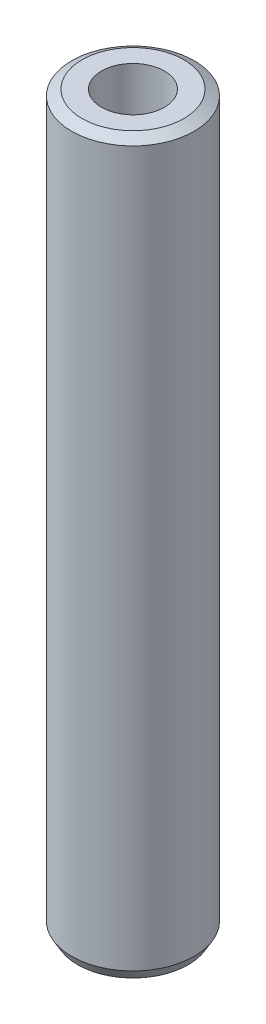
ISO-10303-21;
HEADER;
FILE_DESCRIPTION(('STEP AP214'),'2;1');
FILE_NAME('part.step','',(''),(''),'','','');
FILE_SCHEMA(('AUTOMOTIVE_DESIGN { 1 0 10303 214 1 1 1 1 }'));
ENDSEC;
DATA;
#1=APPLICATION_CONTEXT('core data for automotive mechanical design processes');
#2=APPLICATION_PROTOCOL_DEFINITION('international standard','automotive_design',2000,#1);
#3=PRODUCT_CONTEXT('',#1,'mechanical');
#4=PRODUCT('Part','Part','',(#3));
#5=PRODUCT_RELATED_PRODUCT_CATEGORY('part','',(#4));
#6=PRODUCT_DEFINITION_FORMATION('','',#4);
#7=PRODUCT_DEFINITION_CONTEXT('part definition',#1,'design');
#8=PRODUCT_DEFINITION('design','',#6,#7);
#9=PRODUCT_DEFINITION_SHAPE('','',#8);
#10=(LENGTH_UNIT() NAMED_UNIT(*) SI_UNIT(.MILLI.,.METRE.));
#11=(NAMED_UNIT(*) PLANE_ANGLE_UNIT() SI_UNIT($,.RADIAN.));
#12=(NAMED_UNIT(*) SI_UNIT($,.STERADIAN.) SOLID_ANGLE_UNIT());
#13=UNCERTAINTY_MEASURE_WITH_UNIT(LENGTH_MEASURE(1.E-05),#10,'distance_accuracy_value','');
#14=(GEOMETRIC_REPRESENTATION_CONTEXT(3) GLOBAL_UNCERTAINTY_ASSIGNED_CONTEXT((#13)) GLOBAL_UNIT_ASSIGNED_CONTEXT((#10,
#11,#12)) REPRESENTATION_CONTEXT('',''));
#15=CARTESIAN_POINT('',(0.,0.,0.));
#16=DIRECTION('',(0.,0.,1.));
#17=DIRECTION('',(1.,0.,0.));
#18=AXIS2_PLACEMENT_3D('',#15,#16,#17);
#19=CARTESIAN_POINT('',(0.,149.163204077294,0.));
#20=DIRECTION('',(0.,-1.,0.));
#21=DIRECTION('',(0.,0.,-1.));
#22=AXIS2_PLACEMENT_3D('',#19,#20,#21);
#23=CYLINDRICAL_SURFACE('',#22,12.5);
#24=CARTESIAN_POINT('',(0.,147.95170279504,0.));
#25=DIRECTION('',(0.,1.,0.));
#26=DIRECTION('',(0.,0.,1.));
#27=AXIS2_PLACEMENT_3D('',#24,#25,#26);
#28=CIRCLE('',#27,12.5);
#29=CARTESIAN_POINT('',(0.,147.95170279504,12.5));
#30=VERTEX_POINT('',#29);
#31=EDGE_CURVE('E50',#30,#30,#28,.F.);
#32=ORIENTED_EDGE('',*,*,#31,.T.);
#33=EDGE_LOOP('',(#32));
#34=FACE_BOUND('',#33,.T.);
#35=CARTESIAN_POINT('',(0.,2.09838177429911,0.));
#36=DIRECTION('',(0.,1.,0.));
#37=DIRECTION('',(0.,0.,1.));
#38=AXIS2_PLACEMENT_3D('',#35,#36,#37);
#39=CIRCLE('',#38,12.5);
#40=CARTESIAN_POINT('',(0.,2.09838177429911,12.5));
#41=VERTEX_POINT('',#40);
#42=EDGE_CURVE('E51',#41,#41,#39,.T.);
#43=ORIENTED_EDGE('',*,*,#42,.T.);
#44=EDGE_LOOP('',(#43));
#45=FACE_BOUND('',#44,.T.);
#46=ADVANCED_FACE('F39',(#34,#45),#23,.T.);
#47=CARTESIAN_POINT('',(0.,149.163204077294,0.));
#48=DIRECTION('',(0.,1.,0.));
#49=DIRECTION('',(0.,0.,1.));
#50=AXIS2_PLACEMENT_3D('',#47,#48,#49);
#51=PLANE('',#50);
#52=CARTESIAN_POINT('',(0.,149.163204077294,0.));
#53=DIRECTION('',(0.,1.,0.));
#54=DIRECTION('',(0.,0.,1.));
#55=AXIS2_PLACEMENT_3D('',#52,#53,#54);
#56=CIRCLE('',#55,10.4016182257009);
#57=CARTESIAN_POINT('',(0.,149.163204077294,10.4016182257009));
#58=VERTEX_POINT('',#57);
#59=EDGE_CURVE('E54',#58,#58,#56,.T.);
#60=ORIENTED_EDGE('',*,*,#59,.T.);
#61=EDGE_LOOP('',(#60));
#62=FACE_BOUND('',#61,.T.);
#63=CARTESIAN_POINT('',(0.,149.163204077294,0.));
#64=DIRECTION('',(0.,1.,0.));
#65=DIRECTION('',(0.,0.,1.));
#66=AXIS2_PLACEMENT_3D('',#63,#64,#65);
#67=CIRCLE('',#66,6.42428376195019);
#68=CARTESIAN_POINT('',(0.,149.163204077294,6.42428376195019));
#69=VERTEX_POINT('',#68);
#70=EDGE_CURVE('E58',#69,#69,#67,.T.);
#71=ORIENTED_EDGE('',*,*,#70,.F.);
#72=EDGE_LOOP('',(#71));
#73=FACE_BOUND('',#72,.T.);
#74=ADVANCED_FACE('F69',(#62,#73),#51,.T.);
#75=CARTESIAN_POINT('',(0.,0.,0.));
#76=DIRECTION('',(0.,1.,0.));
#77=DIRECTION('',(0.,0.,1.));
#78=AXIS2_PLACEMENT_3D('',#75,#76,#77);
#79=PLANE('',#78);
#80=CARTESIAN_POINT('',(0.,0.,0.));
#81=DIRECTION('',(0.,1.,0.));
#82=DIRECTION('',(0.,0.,1.));
#83=AXIS2_PLACEMENT_3D('',#80,#81,#82);
#84=CIRCLE('',#83,11.2884987177458);
#85=CARTESIAN_POINT('',(0.,0.,11.2884987177458));
#86=VERTEX_POINT('',#85);
#87=EDGE_CURVE('E10',#86,#86,#84,.F.);
#88=ORIENTED_EDGE('',*,*,#87,.T.);
#89=EDGE_LOOP('',(#88));
#90=FACE_BOUND('',#89,.T.);
#91=CARTESIAN_POINT('',(0.,0.,0.));
#92=DIRECTION('',(0.,1.,0.));
#93=DIRECTION('',(0.,0.,1.));
#94=AXIS2_PLACEMENT_3D('',#91,#92,#93);
#95=CIRCLE('',#94,6.42428376195019);
#96=CARTESIAN_POINT('',(0.,0.,6.42428376195019));
#97=VERTEX_POINT('',#96);
#98=EDGE_CURVE('E63',#97,#97,#95,.T.);
#99=ORIENTED_EDGE('',*,*,#98,.T.);
#100=EDGE_LOOP('',(#99));
#101=FACE_BOUND('',#100,.T.);
#102=ADVANCED_FACE('F75',(#90,#101),#79,.F.);
#103=CARTESIAN_POINT('',(0.,149.163204077294,0.));
#104=DIRECTION('',(0.,-1.,0.));
#105=DIRECTION('',(0.,0.,-1.));
#106=AXIS2_PLACEMENT_3D('',#103,#104,#105);
#107=CYLINDRICAL_SURFACE('',#106,6.42428376195019);
#108=ORIENTED_EDGE('',*,*,#70,.T.);
#109=EDGE_LOOP('',(#108));
#110=FACE_BOUND('',#109,.T.);
#111=ORIENTED_EDGE('',*,*,#98,.F.);
#112=EDGE_LOOP('',(#111));
#113=FACE_BOUND('',#112,.T.);
#114=ADVANCED_FACE('F70',(#110,#113),#107,.F.);
#115=CARTESIAN_POINT('',(0.,149.163204077294,0.));
#116=DIRECTION('',(0.,-1.,0.));
#117=DIRECTION('',(0.,0.,-1.));
#118=AXIS2_PLACEMENT_3D('',#115,#116,#117);
#119=CONICAL_SURFACE('',#118,10.4016182257009,1.0471975511966);
#120=ORIENTED_EDGE('',*,*,#31,.F.);
#121=EDGE_LOOP('',(#120));
#122=FACE_BOUND('',#121,.T.);
#123=ORIENTED_EDGE('',*,*,#59,.F.);
#124=EDGE_LOOP('',(#123));
#125=FACE_BOUND('',#124,.T.);
#126=ADVANCED_FACE('F81',(#122,#125),#119,.T.);
#127=CARTESIAN_POINT('',(0.,2.09838177429911,0.));
#128=DIRECTION('',(0.,1.,0.));
#129=DIRECTION('',(0.,0.,1.));
#130=AXIS2_PLACEMENT_3D('',#127,#128,#129);
#131=CONICAL_SURFACE('',#130,12.5,0.523598775598306);
#132=CARTESIAN_POINT('',(0.,0.,11.2884987177458));
#133=CARTESIAN_POINT('',(0.,0.0218581434822816,11.3011185227693));
#134=CARTESIAN_POINT('',(0.,0.043716286964564,11.3137383277928));
#135=CARTESIAN_POINT('',(0.,0.087432573929129,11.3389779378397));
#136=CARTESIAN_POINT('',(0.,0.109290717411412,11.3515977428632));
#137=CARTESIAN_POINT('',(0.,0.153007004375976,11.3768373529102));
#138=CARTESIAN_POINT('',(0.,0.174865147858258,11.3894571579336));
#139=CARTESIAN_POINT('',(0.,0.218581434822823,11.4146967679806));
#140=CARTESIAN_POINT('',(0.,0.240439578305105,11.4273165730041));
#141=CARTESIAN_POINT('',(0.,0.28415586526967,11.452556183051));
#142=CARTESIAN_POINT('',(0.,0.306014008751953,11.4651759880745));
#143=CARTESIAN_POINT('',(0.,0.349730295716517,11.4904155981215));
#144=CARTESIAN_POINT('',(0.,0.3715884391988,11.503035403145));
#145=CARTESIAN_POINT('',(0.,0.415304726163365,11.5282750131919));
#146=CARTESIAN_POINT('',(0.,0.437162869645647,11.5408948182154));
#147=CARTESIAN_POINT('',(0.,0.480879156610212,11.5661344282624));
#148=CARTESIAN_POINT('',(0.,0.502737300092494,11.5787542332859));
#149=CARTESIAN_POINT('',(0.,0.546453587057059,11.6039938433328));
#150=CARTESIAN_POINT('',(0.,0.568311730539341,11.6166136483563));
#151=CARTESIAN_POINT('',(0.,0.612028017503906,11.6418532584033));
#152=CARTESIAN_POINT('',(0.,0.633886160986188,11.6544730634267));
#153=CARTESIAN_POINT('',(0.,0.677602447950753,11.6797126734737));
#154=CARTESIAN_POINT('',(0.,0.699460591433036,11.6923324784972));
#155=CARTESIAN_POINT('',(0.,0.7431768783976,11.7175720885442));
#156=CARTESIAN_POINT('',(0.,0.765035021879882,11.7301918935676));
#157=CARTESIAN_POINT('',(0.,0.808751308844447,11.7554315036146));
#158=CARTESIAN_POINT('',(0.,0.83060945232673,11.7680513086381));
#159=CARTESIAN_POINT('',(0.,0.874325739291295,11.793290918685));
#160=CARTESIAN_POINT('',(0.,0.896183882773577,11.8059107237085));
#161=CARTESIAN_POINT('',(0.,0.939900169738141,11.8311503337555));
#162=CARTESIAN_POINT('',(0.,0.961758313220424,11.843770138779));
#163=CARTESIAN_POINT('',(0.,1.00547460018499,11.8690097488259));
#164=CARTESIAN_POINT('',(0.,1.02733274366727,11.8816295538494));
#165=CARTESIAN_POINT('',(0.,1.07104903063184,11.9068691638964));
#166=CARTESIAN_POINT('',(0.,1.09290717411412,11.9194889689199));
#167=CARTESIAN_POINT('',(0.,1.13662346107868,11.9447285789668));
#168=CARTESIAN_POINT('',(0.,1.15848160456097,11.9573483839903));
#169=CARTESIAN_POINT('',(0.,1.20219789152553,11.9825879940373));
#170=CARTESIAN_POINT('',(0.,1.22405603500781,11.9952077990607));
#171=CARTESIAN_POINT('',(0.,1.26777232197238,12.0204474091077));
#172=CARTESIAN_POINT('',(0.,1.28963046545466,12.0330672141312));
#173=CARTESIAN_POINT('',(0.,1.33334675241922,12.0583068241782));
#174=CARTESIAN_POINT('',(0.,1.35520489590151,12.0709266292016));
#175=CARTESIAN_POINT('',(0.,1.39892118286607,12.0961662392486));
#176=CARTESIAN_POINT('',(0.,1.42077932634835,12.1087860442721));
#177=CARTESIAN_POINT('',(0.,1.46449561331292,12.134025654319));
#178=CARTESIAN_POINT('',(0.,1.4863537567952,12.1466454593425));
#179=CARTESIAN_POINT('',(0.,1.53007004375977,12.1718850693895));
#180=CARTESIAN_POINT('',(0.,1.55192818724205,12.184504874413));
#181=CARTESIAN_POINT('',(0.,1.59564447420661,12.2097444844599));
#182=CARTESIAN_POINT('',(0.,1.6175026176889,12.2223642894834));
#183=CARTESIAN_POINT('',(0.,1.66121890465346,12.2476038995304));
#184=CARTESIAN_POINT('',(0.,1.68307704813574,12.2602237045539));
#185=CARTESIAN_POINT('',(0.,1.72679333510031,12.2854633146008));
#186=CARTESIAN_POINT('',(0.,1.74865147858259,12.2980831196243));
#187=CARTESIAN_POINT('',(0.,1.79236776554715,12.3233227296713));
#188=CARTESIAN_POINT('',(0.,1.81422590902944,12.3359425346947));
#189=CARTESIAN_POINT('',(0.,1.857942195994,12.3611821447417));
#190=CARTESIAN_POINT('',(0.,1.87980033947628,12.3738019497652));
#191=CARTESIAN_POINT('',(0.,1.92351662644085,12.3990415598121));
#192=CARTESIAN_POINT('',(0.,1.94537476992313,12.4116613648356));
#193=CARTESIAN_POINT('',(0.,1.9890910568877,12.4369009748826));
#194=CARTESIAN_POINT('',(0.,2.01094920036998,12.4495207799061));
#195=CARTESIAN_POINT('',(0.,2.05466548733454,12.474760389953));
#196=CARTESIAN_POINT('',(0.,2.07652363081682,12.4873801949765));
#197=CARTESIAN_POINT('',(0.,2.09838177429911,12.5));
#198=B_SPLINE_CURVE_WITH_KNOTS('',3,(#132,#133,#134,#135,#136,#137,#138,#139,#140,#141,#142,
#143,#144,#145,#146,#147,#148,#149,#150,#151,#152,#153,#154,#155,#156,#157,#158,#159,#160,#161,
#162,#163,#164,#165,#166,#167,#168,#169,#170,#171,#172,#173,#174,#175,#176,#177,#178,#179,#180,
#181,#182,#183,#184,#185,#186,#187,#188,#189,#190,#191,#192,#193,#194,#195,#196,#197),
.UNSPECIFIED.,.F.,.F.,(4,2,2,2,2,2,2,2,2,2,2,2,2,2,2,2,2,2,2,2,2,2,2,2,2,2,2,2,2,2,2,2,4),(0.,
0.0757188301408876,0.151437660281774,0.227156490422662,0.302875320563549,0.378594150704437,
0.454312980845325,0.530031810986211,0.605750641127099,0.681469471267987,0.757188301408874,
0.832907131549762,0.908625961690649,0.984344791831536,1.06006362197242,1.13578245211331,
1.2115012822542,1.28722011239509,1.36293894253597,1.43865777267686,1.51437660281775,
1.59009543295864,1.66581426309952,1.74153309324041,1.8172519233813,1.89297075352219,
1.96868958366307,2.04440841380396,2.12012724394485,2.19584607408574,2.27156490422662,
2.34728373436751,2.4230025645084),.UNSPECIFIED.);
#199=EDGE_CURVE('BSEAM45',#86,#41,#198,.T.);
#200=ORIENTED_EDGE('',*,*,#87,.F.);
#201=ORIENTED_EDGE('',*,*,#42,.F.);
#202=ORIENTED_EDGE('',*,*,#199,.T.);
#203=ORIENTED_EDGE('',*,*,#199,.F.);
#204=EDGE_LOOP('',(#200,#202,#201,#203));
#205=FACE_BOUND('',#204,.T.);
#206=ADVANCED_FACE('F45',(#205),#131,.T.);
#207=CLOSED_SHELL('',(#46,#74,#102,#114,#126,#206));
#208=MANIFOLD_SOLID_BREP('B2',#207);
#209=ADVANCED_BREP_SHAPE_REPRESENTATION('',(#18,#208),#14);
#210=SHAPE_DEFINITION_REPRESENTATION(#9,#209);
ENDSEC;
END-ISO-10303-21;
